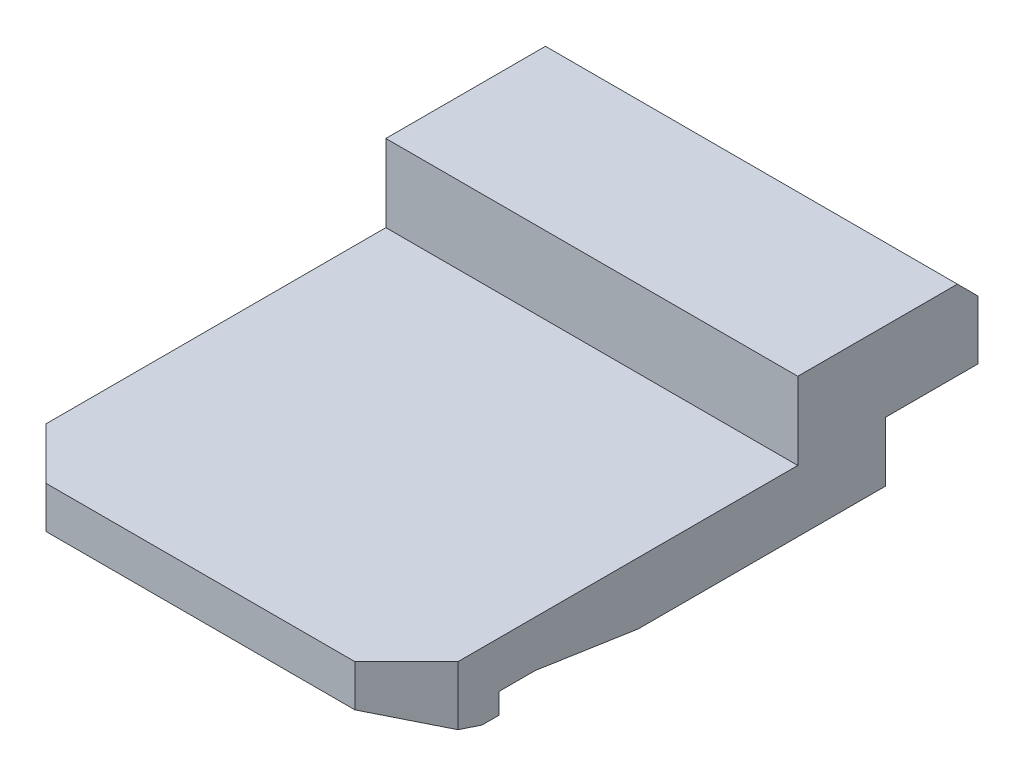
ISO-10303-21;
HEADER;
FILE_DESCRIPTION(('STEP AP214'),'2;1');
FILE_NAME('part.step','',(''),(''),'','','');
FILE_SCHEMA(('AUTOMOTIVE_DESIGN { 1 0 10303 214 1 1 1 1 }'));
ENDSEC;
DATA;
#1=APPLICATION_CONTEXT('core data for automotive mechanical design processes');
#2=APPLICATION_PROTOCOL_DEFINITION('international standard','automotive_design',2000,#1);
#3=PRODUCT_CONTEXT('',#1,'mechanical');
#4=PRODUCT('Part','Part','',(#3));
#5=PRODUCT_RELATED_PRODUCT_CATEGORY('part','',(#4));
#6=PRODUCT_DEFINITION_FORMATION('','',#4);
#7=PRODUCT_DEFINITION_CONTEXT('part definition',#1,'design');
#8=PRODUCT_DEFINITION('design','',#6,#7);
#9=PRODUCT_DEFINITION_SHAPE('','',#8);
#10=(LENGTH_UNIT() NAMED_UNIT(*) SI_UNIT(.MILLI.,.METRE.));
#11=(NAMED_UNIT(*) PLANE_ANGLE_UNIT() SI_UNIT($,.RADIAN.));
#12=(NAMED_UNIT(*) SI_UNIT($,.STERADIAN.) SOLID_ANGLE_UNIT());
#13=UNCERTAINTY_MEASURE_WITH_UNIT(LENGTH_MEASURE(1.E-05),#10,'distance_accuracy_value','');
#14=(GEOMETRIC_REPRESENTATION_CONTEXT(3) GLOBAL_UNCERTAINTY_ASSIGNED_CONTEXT((#13)) GLOBAL_UNIT_ASSIGNED_CONTEXT((#10,
#11,#12)) REPRESENTATION_CONTEXT('',''));
#15=CARTESIAN_POINT('',(0.,0.,0.));
#16=DIRECTION('',(0.,0.,1.));
#17=DIRECTION('',(1.,0.,0.));
#18=AXIS2_PLACEMENT_3D('',#15,#16,#17);
#19=CARTESIAN_POINT('',(0.,11.05,-16.8));
#20=DIRECTION('',(0.,0.707106781186548,-0.707106781186548));
#21=DIRECTION('',(-1.,0.,0.));
#22=AXIS2_PLACEMENT_3D('',#19,#20,#21);
#23=PLANE('',#22);
#24=DIRECTION('',(0.,0.707106781186498,0.707106781186598));
#25=VECTOR('',#24,1.);
#26=CARTESIAN_POINT('',(4.,10.85,-17.));
#27=LINE('',#26,#25);
#28=CARTESIAN_POINT('',(4.,10.85,-17.));
#29=VERTEX_POINT('',#28);
#30=CARTESIAN_POINT('',(4.,11.25,-16.6));
#31=VERTEX_POINT('',#30);
#32=EDGE_CURVE('E262',#29,#31,#27,.T.);
#33=ORIENTED_EDGE('',*,*,#32,.F.);
#34=DIRECTION('',(1.,0.,0.));
#35=VECTOR('',#34,1.);
#36=CARTESIAN_POINT('',(-4.,10.85,-17.));
#37=LINE('',#36,#35);
#38=CARTESIAN_POINT('',(-4.,10.85,-17.));
#39=VERTEX_POINT('',#38);
#40=EDGE_CURVE('E244',#39,#29,#37,.T.);
#41=ORIENTED_EDGE('',*,*,#40,.F.);
#42=DIRECTION('',(0.,-0.707106781186498,-0.707106781186598));
#43=VECTOR('',#42,1.);
#44=CARTESIAN_POINT('',(-4.,11.25,-16.6));
#45=LINE('',#44,#43);
#46=CARTESIAN_POINT('',(-4.,11.25,-16.6));
#47=VERTEX_POINT('',#46);
#48=EDGE_CURVE('E289',#47,#39,#45,.T.);
#49=ORIENTED_EDGE('',*,*,#48,.F.);
#50=DIRECTION('',(1.,0.,0.));
#51=VECTOR('',#50,1.);
#52=CARTESIAN_POINT('',(-4.,11.25,-16.6));
#53=LINE('',#52,#51);
#54=EDGE_CURVE('E11',#47,#31,#53,.T.);
#55=ORIENTED_EDGE('',*,*,#54,.T.);
#56=EDGE_LOOP('',(#33,#41,#49,#55));
#57=FACE_BOUND('',#56,.T.);
#58=ADVANCED_FACE('F16',(#57),#23,.T.);
#59=CARTESIAN_POINT('',(4.,11.25,-17.));
#60=DIRECTION('',(0.,1.,0.));
#61=DIRECTION('',(1.,0.,0.));
#62=AXIS2_PLACEMENT_3D('',#59,#60,#61);
#63=PLANE('',#62);
#64=ORIENTED_EDGE('',*,*,#54,.F.);
#65=DIRECTION('',(0.,0.,-1.));
#66=VECTOR('',#65,1.);
#67=CARTESIAN_POINT('',(-4.,11.25,-13.5));
#68=LINE('',#67,#66);
#69=CARTESIAN_POINT('',(-4.,11.25,-13.5));
#70=VERTEX_POINT('',#69);
#71=EDGE_CURVE('E285',#70,#47,#68,.T.);
#72=ORIENTED_EDGE('',*,*,#71,.F.);
#73=DIRECTION('',(1.,0.,0.));
#74=VECTOR('',#73,1.);
#75=CARTESIAN_POINT('',(-4.,11.25,-13.5));
#76=LINE('',#75,#74);
#77=CARTESIAN_POINT('',(4.,11.25,-13.5));
#78=VERTEX_POINT('',#77);
#79=EDGE_CURVE('E338',#70,#78,#76,.T.);
#80=ORIENTED_EDGE('',*,*,#79,.T.);
#81=DIRECTION('',(0.,0.,-1.));
#82=VECTOR('',#81,1.);
#83=CARTESIAN_POINT('',(4.,11.25,-13.5));
#84=LINE('',#83,#82);
#85=EDGE_CURVE('E257',#78,#31,#84,.T.);
#86=ORIENTED_EDGE('',*,*,#85,.T.);
#87=EDGE_LOOP('',(#64,#72,#80,#86));
#88=FACE_BOUND('',#87,.T.);
#89=ADVANCED_FACE('F492',(#88),#63,.T.);
#90=CARTESIAN_POINT('',(4.,0.,-14.7));
#91=DIRECTION('',(0.,0.,-1.));
#92=DIRECTION('',(0.,-1.,0.));
#93=AXIS2_PLACEMENT_3D('',#90,#91,#92);
#94=PLANE('',#93);
#95=DIRECTION('',(1.,0.,0.));
#96=VECTOR('',#95,1.);
#97=CARTESIAN_POINT('',(-3.115686120263,8.55,-14.7));
#98=LINE('',#97,#96);
#99=CARTESIAN_POINT('',(-3.115686120263,8.55,-14.7));
#100=VERTEX_POINT('',#99);
#101=CARTESIAN_POINT('',(3.115686120263,8.55,-14.7));
#102=VERTEX_POINT('',#101);
#103=EDGE_CURVE('E190',#100,#102,#98,.T.);
#104=ORIENTED_EDGE('',*,*,#103,.F.);
#105=CARTESIAN_POINT('',(0.,0.,-14.7));
#106=DIRECTION('',(0.,0.,-1.));
#107=DIRECTION('',(-0.342383090138813,0.939560439560435,0.));
#108=AXIS2_PLACEMENT_3D('',#105,#106,#107);
#109=CIRCLE('',#108,9.1);
#110=EDGE_CURVE('E24',#100,#102,#109,.T.);
#111=ORIENTED_EDGE('',*,*,#110,.T.);
#112=EDGE_LOOP('',(#104,#111));
#113=FACE_BOUND('',#112,.T.);
#114=ADVANCED_FACE('F517',(#113),#94,.T.);
#115=CARTESIAN_POINT('',(0.,0.,-15.2));
#116=DIRECTION('',(0.,0.,-1.));
#117=DIRECTION('',(-1.,0.,0.));
#118=AXIS2_PLACEMENT_3D('',#115,#116,#117);
#119=CYLINDRICAL_SURFACE('',#118,9.1);
#120=DIRECTION('',(0.,0.,-1.));
#121=VECTOR('',#120,1.);
#122=CARTESIAN_POINT('',(-3.115686120263,8.55,-14.7));
#123=LINE('',#122,#121);
#124=CARTESIAN_POINT('',(-3.115686120263,8.55,-15.2));
#125=VERTEX_POINT('',#124);
#126=EDGE_CURVE('E185',#100,#125,#123,.T.);
#127=ORIENTED_EDGE('',*,*,#126,.T.);
#128=CARTESIAN_POINT('',(0.,0.,-15.2));
#129=DIRECTION('',(0.,0.,-1.));
#130=DIRECTION('',(-0.342383090138813,0.939560439560435,0.));
#131=AXIS2_PLACEMENT_3D('',#128,#129,#130);
#132=CIRCLE('',#131,9.1);
#133=CARTESIAN_POINT('',(3.115686120263,8.55,-15.2));
#134=VERTEX_POINT('',#133);
#135=EDGE_CURVE('E36',#125,#134,#132,.T.);
#136=ORIENTED_EDGE('',*,*,#135,.T.);
#137=DIRECTION('',(0.,0.,-1.));
#138=VECTOR('',#137,1.);
#139=CARTESIAN_POINT('',(3.115686120263,8.55,-14.7));
#140=LINE('',#139,#138);
#141=EDGE_CURVE('E208',#102,#134,#140,.T.);
#142=ORIENTED_EDGE('',*,*,#141,.F.);
#143=ORIENTED_EDGE('',*,*,#110,.F.);
#144=EDGE_LOOP('',(#127,#136,#142,#143));
#145=FACE_BOUND('',#144,.T.);
#146=ADVANCED_FACE('F186',(#145),#119,.F.);
#147=CARTESIAN_POINT('',(4.,8.55,-15.2));
#148=DIRECTION('',(0.,0.,-1.));
#149=DIRECTION('',(0.,-1.,0.));
#150=AXIS2_PLACEMENT_3D('',#147,#148,#149);
#151=PLANE('',#150);
#152=ORIENTED_EDGE('',*,*,#135,.F.);
#153=DIRECTION('',(1.,0.,0.));
#154=VECTOR('',#153,1.);
#155=CARTESIAN_POINT('',(-4.,8.55,-15.2));
#156=LINE('',#155,#154);
#157=CARTESIAN_POINT('',(-4.,8.55,-15.2));
#158=VERTEX_POINT('',#157);
#159=EDGE_CURVE('E177',#158,#125,#156,.T.);
#160=ORIENTED_EDGE('',*,*,#159,.F.);
#161=DIRECTION('',(0.,1.,0.));
#162=VECTOR('',#161,1.);
#163=CARTESIAN_POINT('',(-4.,8.55,-15.2));
#164=LINE('',#163,#162);
#165=CARTESIAN_POINT('',(-4.,9.708243919474,-15.2));
#166=VERTEX_POINT('',#165);
#167=EDGE_CURVE('E293',#158,#166,#164,.T.);
#168=ORIENTED_EDGE('',*,*,#167,.T.);
#169=CARTESIAN_POINT('',(0.,0.,-15.2));
#170=DIRECTION('',(0.,0.,-1.));
#171=DIRECTION('',(-0.380952380952399,0.924594658997497,0.));
#172=AXIS2_PLACEMENT_3D('',#169,#170,#171);
#173=CIRCLE('',#172,10.5);
#174=CARTESIAN_POINT('',(4.,9.708243919474,-15.2));
#175=VERTEX_POINT('',#174);
#176=EDGE_CURVE('E223',#166,#175,#173,.T.);
#177=ORIENTED_EDGE('',*,*,#176,.T.);
#178=DIRECTION('',(0.,-1.,0.));
#179=VECTOR('',#178,1.);
#180=CARTESIAN_POINT('',(4.,9.708243919474,-15.2));
#181=LINE('',#180,#179);
#182=CARTESIAN_POINT('',(4.,8.55,-15.2));
#183=VERTEX_POINT('',#182);
#184=EDGE_CURVE('E381',#175,#183,#181,.T.);
#185=ORIENTED_EDGE('',*,*,#184,.T.);
#186=DIRECTION('',(1.,0.,0.));
#187=VECTOR('',#186,1.);
#188=CARTESIAN_POINT('',(3.115686120263,8.55,-15.2));
#189=LINE('',#188,#187);
#190=EDGE_CURVE('E180',#134,#183,#189,.T.);
#191=ORIENTED_EDGE('',*,*,#190,.F.);
#192=EDGE_LOOP('',(#152,#160,#168,#177,#185,#191));
#193=FACE_BOUND('',#192,.T.);
#194=ADVANCED_FACE('F175',(#193),#151,.T.);
#195=CARTESIAN_POINT('',(4.,8.55,-5.9));
#196=DIRECTION('',(0.,-1.,0.));
#197=DIRECTION('',(0.,0.,-1.));
#198=AXIS2_PLACEMENT_3D('',#195,#196,#197);
#199=PLANE('',#198);
#200=DIRECTION('',(-1.,0.,0.));
#201=VECTOR('',#200,1.);
#202=CARTESIAN_POINT('',(4.,8.55,-10.4));
#203=LINE('',#202,#201);
#204=CARTESIAN_POINT('',(4.,8.55,-10.4));
#205=VERTEX_POINT('',#204);
#206=CARTESIAN_POINT('',(-4.,8.55,-10.4));
#207=VERTEX_POINT('',#206);
#208=EDGE_CURVE('E197',#205,#207,#203,.T.);
#209=ORIENTED_EDGE('',*,*,#208,.T.);
#210=DIRECTION('',(0.,0.,1.));
#211=VECTOR('',#210,1.);
#212=CARTESIAN_POINT('',(-4.,8.55,-15.2));
#213=LINE('',#212,#211);
#214=EDGE_CURVE('E194',#158,#207,#213,.T.);
#215=ORIENTED_EDGE('',*,*,#214,.F.);
#216=ORIENTED_EDGE('',*,*,#159,.T.);
#217=ORIENTED_EDGE('',*,*,#126,.F.);
#218=ORIENTED_EDGE('',*,*,#103,.T.);
#219=ORIENTED_EDGE('',*,*,#141,.T.);
#220=ORIENTED_EDGE('',*,*,#190,.T.);
#221=DIRECTION('',(0.,0.,-1.));
#222=VECTOR('',#221,1.);
#223=CARTESIAN_POINT('',(4.,8.55,-10.4));
#224=LINE('',#223,#222);
#225=EDGE_CURVE('E377',#205,#183,#224,.T.);
#226=ORIENTED_EDGE('',*,*,#225,.F.);
#227=EDGE_LOOP('',(#209,#215,#216,#217,#218,#219,#220,#226));
#228=FACE_BOUND('',#227,.T.);
#229=ADVANCED_FACE('F192',(#228),#199,.T.);
#230=CARTESIAN_POINT('',(0.,8.7,-9.4));
#231=DIRECTION('',(0.,-0.988936352868304,0.148340452930201));
#232=DIRECTION('',(-1.,0.,0.));
#233=AXIS2_PLACEMENT_3D('',#230,#231,#232);
#234=PLANE('',#233);
#235=DIRECTION('',(0.,0.148340452930201,0.988936352868304));
#236=VECTOR('',#235,1.);
#237=CARTESIAN_POINT('',(-4.,8.55,-10.4));
#238=LINE('',#237,#236);
#239=CARTESIAN_POINT('',(-4.,8.85,-8.4));
#240=VERTEX_POINT('',#239);
#241=EDGE_CURVE('E298',#207,#240,#238,.T.);
#242=ORIENTED_EDGE('',*,*,#241,.F.);
#243=ORIENTED_EDGE('',*,*,#208,.F.);
#244=DIRECTION('',(0.,-0.148340452930201,-0.988936352868304));
#245=VECTOR('',#244,1.);
#246=CARTESIAN_POINT('',(4.,8.85,-8.4));
#247=LINE('',#246,#245);
#248=CARTESIAN_POINT('',(4.,8.85,-8.4));
#249=VERTEX_POINT('',#248);
#250=EDGE_CURVE('E373',#249,#205,#247,.T.);
#251=ORIENTED_EDGE('',*,*,#250,.F.);
#252=DIRECTION('',(-1.,0.,0.));
#253=VECTOR('',#252,1.);
#254=CARTESIAN_POINT('',(4.,8.85,-8.4));
#255=LINE('',#254,#253);
#256=EDGE_CURVE('E202',#249,#240,#255,.T.);
#257=ORIENTED_EDGE('',*,*,#256,.T.);
#258=EDGE_LOOP('',(#242,#243,#251,#257));
#259=FACE_BOUND('',#258,.T.);
#260=ADVANCED_FACE('F576',(#259),#234,.T.);
#261=CARTESIAN_POINT('',(-4.,8.85,-7.7));
#262=DIRECTION('',(0.,1.,0.));
#263=DIRECTION('',(1.,0.,0.));
#264=AXIS2_PLACEMENT_3D('',#261,#262,#263);
#265=PLANE('',#264);
#266=ORIENTED_EDGE('',*,*,#256,.F.);
#267=DIRECTION('',(0.,0.,-1.));
#268=VECTOR('',#267,1.);
#269=CARTESIAN_POINT('',(4.,8.85,-7.7));
#270=LINE('',#269,#268);
#271=CARTESIAN_POINT('',(4.,8.85,-7.7));
#272=VERTEX_POINT('',#271);
#273=EDGE_CURVE('E369',#272,#249,#270,.T.);
#274=ORIENTED_EDGE('',*,*,#273,.F.);
#275=DIRECTION('',(1.,0.,0.));
#276=VECTOR('',#275,1.);
#277=CARTESIAN_POINT('',(-4.,8.85,-7.7));
#278=LINE('',#277,#276);
#279=CARTESIAN_POINT('',(-4.,8.85,-7.7));
#280=VERTEX_POINT('',#279);
#281=EDGE_CURVE('E292',#280,#272,#278,.T.);
#282=ORIENTED_EDGE('',*,*,#281,.F.);
#283=DIRECTION('',(0.,0.,-1.));
#284=VECTOR('',#283,1.);
#285=CARTESIAN_POINT('',(-4.,8.85,-7.7));
#286=LINE('',#285,#284);
#287=EDGE_CURVE('E302',#280,#240,#286,.T.);
#288=ORIENTED_EDGE('',*,*,#287,.T.);
#289=EDGE_LOOP('',(#266,#274,#282,#288));
#290=FACE_BOUND('',#289,.T.);
#291=ADVANCED_FACE('F412',(#290),#265,.F.);
#292=CARTESIAN_POINT('',(-4.,8.55,-7.7));
#293=DIRECTION('',(0.,0.,1.));
#294=DIRECTION('',(1.,0.,0.));
#295=AXIS2_PLACEMENT_3D('',#292,#293,#294);
#296=PLANE('',#295);
#297=DIRECTION('',(0.,1.,0.));
#298=VECTOR('',#297,1.);
#299=CARTESIAN_POINT('',(-4.,8.45,-7.7));
#300=LINE('',#299,#298);
#301=CARTESIAN_POINT('',(-4.,8.45,-7.7));
#302=VERTEX_POINT('',#301);
#303=EDGE_CURVE('E269',#302,#280,#300,.T.);
#304=ORIENTED_EDGE('',*,*,#303,.T.);
#305=ORIENTED_EDGE('',*,*,#281,.T.);
#306=DIRECTION('',(0.,1.,0.));
#307=VECTOR('',#306,1.);
#308=CARTESIAN_POINT('',(4.,8.45,-7.7));
#309=LINE('',#308,#307);
#310=CARTESIAN_POINT('',(4.,8.45,-7.7));
#311=VERTEX_POINT('',#310);
#312=EDGE_CURVE('E365',#311,#272,#309,.T.);
#313=ORIENTED_EDGE('',*,*,#312,.F.);
#314=DIRECTION('',(-1.,0.,0.));
#315=VECTOR('',#314,1.);
#316=CARTESIAN_POINT('',(4.,8.45,-7.7));
#317=LINE('',#316,#315);
#318=EDGE_CURVE('E205',#311,#302,#317,.T.);
#319=ORIENTED_EDGE('',*,*,#318,.T.);
#320=EDGE_LOOP('',(#304,#305,#313,#319));
#321=FACE_BOUND('',#320,.T.);
#322=ADVANCED_FACE('F401',(#321),#296,.F.);
#323=CARTESIAN_POINT('',(4.,8.45,-7.366666666667));
#324=DIRECTION('',(0.,-1.,0.));
#325=DIRECTION('',(0.,0.,-1.));
#326=AXIS2_PLACEMENT_3D('',#323,#324,#325);
#327=PLANE('',#326);
#328=DIRECTION('',(0.,0.,-1.));
#329=VECTOR('',#328,1.);
#330=CARTESIAN_POINT('',(4.,8.45,-7.366666666667));
#331=LINE('',#330,#329);
#332=CARTESIAN_POINT('',(4.,8.45,-7.366666666667));
#333=VERTEX_POINT('',#332);
#334=EDGE_CURVE('E360',#333,#311,#331,.T.);
#335=ORIENTED_EDGE('',*,*,#334,.F.);
#336=DIRECTION('',(-1.,0.,0.));
#337=VECTOR('',#336,1.);
#338=CARTESIAN_POINT('',(4.,8.45,-7.366666666667));
#339=LINE('',#338,#337);
#340=CARTESIAN_POINT('',(-4.,8.45,-7.366666666667));
#341=VERTEX_POINT('',#340);
#342=EDGE_CURVE('E330',#333,#341,#339,.T.);
#343=ORIENTED_EDGE('',*,*,#342,.T.);
#344=DIRECTION('',(0.,0.,-1.));
#345=VECTOR('',#344,1.);
#346=CARTESIAN_POINT('',(-4.,8.45,-7.366666666667));
#347=LINE('',#346,#345);
#348=EDGE_CURVE('E264',#341,#302,#347,.T.);
#349=ORIENTED_EDGE('',*,*,#348,.T.);
#350=ORIENTED_EDGE('',*,*,#318,.F.);
#351=EDGE_LOOP('',(#335,#343,#349,#350));
#352=FACE_BOUND('',#351,.T.);
#353=ADVANCED_FACE('F405',(#352),#327,.T.);
#354=CARTESIAN_POINT('',(4.,8.938888888889,-5.9));
#355=DIRECTION('',(0.,-0.948683298050524,0.316227766016808));
#356=DIRECTION('',(-1.,0.,0.));
#357=AXIS2_PLACEMENT_3D('',#354,#355,#356);
#358=PLANE('',#357);
#359=DIRECTION('',(-0.68824720161168,0.229415733870593,0.68824720161168));
#360=VECTOR('',#359,1.);
#361=CARTESIAN_POINT('',(4.,8.605555555556,-6.9));
#362=LINE('',#361,#360);
#363=CARTESIAN_POINT('',(4.,8.605555555556,-6.9));
#364=VERTEX_POINT('',#363);
#365=CARTESIAN_POINT('',(3.,8.938888888889,-5.9));
#366=VERTEX_POINT('',#365);
#367=EDGE_CURVE('E317',#364,#366,#362,.T.);
#368=ORIENTED_EDGE('',*,*,#367,.T.);
#369=DIRECTION('',(-1.,0.,0.));
#370=VECTOR('',#369,1.);
#371=CARTESIAN_POINT('',(3.,8.938888888889,-5.9));
#372=LINE('',#371,#370);
#373=CARTESIAN_POINT('',(-3.,8.938888888889,-5.9));
#374=VERTEX_POINT('',#373);
#375=EDGE_CURVE('E316',#366,#374,#372,.T.);
#376=ORIENTED_EDGE('',*,*,#375,.T.);
#377=DIRECTION('',(-0.68824720161168,-0.229415733870593,-0.68824720161168));
#378=VECTOR('',#377,1.);
#379=CARTESIAN_POINT('',(-3.,8.938888888889,-5.9));
#380=LINE('',#379,#378);
#381=CARTESIAN_POINT('',(-4.,8.605555555556,-6.9));
#382=VERTEX_POINT('',#381);
#383=EDGE_CURVE('E327',#374,#382,#380,.T.);
#384=ORIENTED_EDGE('',*,*,#383,.T.);
#385=DIRECTION('',(0.,-0.316227766016808,-0.948683298050524));
#386=VECTOR('',#385,1.);
#387=CARTESIAN_POINT('',(-4.,8.605555555556,-6.9));
#388=LINE('',#387,#386);
#389=EDGE_CURVE('E268',#382,#341,#388,.T.);
#390=ORIENTED_EDGE('',*,*,#389,.T.);
#391=ORIENTED_EDGE('',*,*,#342,.F.);
#392=DIRECTION('',(0.,-0.316227766016808,-0.948683298050524));
#393=VECTOR('',#392,1.);
#394=CARTESIAN_POINT('',(4.,8.605555555556,-6.9));
#395=LINE('',#394,#393);
#396=EDGE_CURVE('E357',#364,#333,#395,.T.);
#397=ORIENTED_EDGE('',*,*,#396,.F.);
#398=EDGE_LOOP('',(#368,#376,#384,#390,#391,#397));
#399=FACE_BOUND('',#398,.T.);
#400=ADVANCED_FACE('F420',(#399),#358,.T.);
#401=CARTESIAN_POINT('',(-3.5,9.35,-6.4));
#402=DIRECTION('',(-0.707106781186548,0.,0.707106781186548));
#403=DIRECTION('',(0.,1.,0.));
#404=AXIS2_PLACEMENT_3D('',#401,#402,#403);
#405=PLANE('',#404);
#406=DIRECTION('',(0.,1.,0.));
#407=VECTOR('',#406,1.);
#408=CARTESIAN_POINT('',(-4.,8.605555555556,-6.9));
#409=LINE('',#408,#407);
#410=CARTESIAN_POINT('',(-4.,9.75,-6.9));
#411=VERTEX_POINT('',#410);
#412=EDGE_CURVE('E312',#382,#411,#409,.T.);
#413=ORIENTED_EDGE('',*,*,#412,.F.);
#414=ORIENTED_EDGE('',*,*,#383,.F.);
#415=DIRECTION('',(0.,1.,0.));
#416=VECTOR('',#415,1.);
#417=CARTESIAN_POINT('',(-3.,8.938888888889,-5.9));
#418=LINE('',#417,#416);
#419=CARTESIAN_POINT('',(-3.,9.75,-5.9));
#420=VERTEX_POINT('',#419);
#421=EDGE_CURVE('E313',#374,#420,#418,.T.);
#422=ORIENTED_EDGE('',*,*,#421,.T.);
#423=DIRECTION('',(0.707106781186548,0.,0.707106781186548));
#424=VECTOR('',#423,1.);
#425=CARTESIAN_POINT('',(-4.,9.75,-6.9));
#426=LINE('',#425,#424);
#427=EDGE_CURVE('E254',#411,#420,#426,.T.);
#428=ORIENTED_EDGE('',*,*,#427,.F.);
#429=EDGE_LOOP('',(#413,#414,#422,#428));
#430=FACE_BOUND('',#429,.T.);
#431=ADVANCED_FACE('F426',(#430),#405,.T.);
#432=CARTESIAN_POINT('',(4.,9.65,-5.9));
#433=DIRECTION('',(0.,0.,1.));
#434=DIRECTION('',(1.,0.,0.));
#435=AXIS2_PLACEMENT_3D('',#432,#433,#434);
#436=PLANE('',#435);
#437=ORIENTED_EDGE('',*,*,#421,.F.);
#438=ORIENTED_EDGE('',*,*,#375,.F.);
#439=DIRECTION('',(0.,-1.,0.));
#440=VECTOR('',#439,1.);
#441=CARTESIAN_POINT('',(3.,9.75,-5.9));
#442=LINE('',#441,#440);
#443=CARTESIAN_POINT('',(3.,9.75,-5.9));
#444=VERTEX_POINT('',#443);
#445=EDGE_CURVE('E261',#444,#366,#442,.T.);
#446=ORIENTED_EDGE('',*,*,#445,.F.);
#447=DIRECTION('',(1.,0.,0.));
#448=VECTOR('',#447,1.);
#449=CARTESIAN_POINT('',(-3.,9.75,-5.9));
#450=LINE('',#449,#448);
#451=EDGE_CURVE('E342',#420,#444,#450,.T.);
#452=ORIENTED_EDGE('',*,*,#451,.F.);
#453=EDGE_LOOP('',(#437,#438,#446,#452));
#454=FACE_BOUND('',#453,.T.);
#455=ADVANCED_FACE('F505',(#454),#436,.T.);
#456=CARTESIAN_POINT('',(3.5,9.35,-6.4));
#457=DIRECTION('',(0.707106781186548,0.,0.707106781186548));
#458=DIRECTION('',(0.,-1.,0.));
#459=AXIS2_PLACEMENT_3D('',#456,#457,#458);
#460=PLANE('',#459);
#461=ORIENTED_EDGE('',*,*,#445,.T.);
#462=ORIENTED_EDGE('',*,*,#367,.F.);
#463=DIRECTION('',(0.,1.,0.));
#464=VECTOR('',#463,1.);
#465=CARTESIAN_POINT('',(4.,8.605555555556,-6.9));
#466=LINE('',#465,#464);
#467=CARTESIAN_POINT('',(4.,9.75,-6.9));
#468=VERTEX_POINT('',#467);
#469=EDGE_CURVE('E354',#364,#468,#466,.T.);
#470=ORIENTED_EDGE('',*,*,#469,.T.);
#471=DIRECTION('',(0.707106781186548,0.,-0.707106781186548));
#472=VECTOR('',#471,1.);
#473=CARTESIAN_POINT('',(3.,9.75,-5.9));
#474=LINE('',#473,#472);
#475=EDGE_CURVE('E346',#444,#468,#474,.T.);
#476=ORIENTED_EDGE('',*,*,#475,.F.);
#477=EDGE_LOOP('',(#461,#462,#470,#476));
#478=FACE_BOUND('',#477,.T.);
#479=ADVANCED_FACE('F508',(#478),#460,.T.);
#480=CARTESIAN_POINT('',(4.,9.45,-17.));
#481=DIRECTION('',(1.,0.,0.));
#482=DIRECTION('',(0.,1.,0.));
#483=AXIS2_PLACEMENT_3D('',#480,#481,#482);
#484=PLANE('',#483);
#485=ORIENTED_EDGE('',*,*,#469,.F.);
#486=ORIENTED_EDGE('',*,*,#396,.T.);
#487=ORIENTED_EDGE('',*,*,#334,.T.);
#488=ORIENTED_EDGE('',*,*,#312,.T.);
#489=ORIENTED_EDGE('',*,*,#273,.T.);
#490=ORIENTED_EDGE('',*,*,#250,.T.);
#491=ORIENTED_EDGE('',*,*,#225,.T.);
#492=ORIENTED_EDGE('',*,*,#184,.F.);
#493=DIRECTION('',(0.,0.,-1.));
#494=VECTOR('',#493,1.);
#495=CARTESIAN_POINT('',(4.,9.708243919474,-15.2));
#496=LINE('',#495,#494);
#497=CARTESIAN_POINT('',(4.,9.708243919474,-17.));
#498=VERTEX_POINT('',#497);
#499=EDGE_CURVE('E227',#175,#498,#496,.T.);
#500=ORIENTED_EDGE('',*,*,#499,.T.);
#501=DIRECTION('',(0.,-1.,0.));
#502=VECTOR('',#501,1.);
#503=CARTESIAN_POINT('',(4.,10.85,-17.));
#504=LINE('',#503,#502);
#505=EDGE_CURVE('E247',#29,#498,#504,.T.);
#506=ORIENTED_EDGE('',*,*,#505,.F.);
#507=ORIENTED_EDGE('',*,*,#32,.T.);
#508=ORIENTED_EDGE('',*,*,#85,.F.);
#509=DIRECTION('',(0.,-1.,0.));
#510=VECTOR('',#509,1.);
#511=CARTESIAN_POINT('',(4.,11.25,-13.5));
#512=LINE('',#511,#510);
#513=CARTESIAN_POINT('',(4.,9.75,-13.5));
#514=VERTEX_POINT('',#513);
#515=EDGE_CURVE('E334',#78,#514,#512,.T.);
#516=ORIENTED_EDGE('',*,*,#515,.T.);
#517=DIRECTION('',(0.,0.,-1.));
#518=VECTOR('',#517,1.);
#519=CARTESIAN_POINT('',(4.,9.75,-6.9));
#520=LINE('',#519,#518);
#521=EDGE_CURVE('E350',#468,#514,#520,.T.);
#522=ORIENTED_EDGE('',*,*,#521,.F.);
#523=EDGE_LOOP('',(#485,#486,#487,#488,#489,#490,#491,#492,#500,#506,#507,#508,#516,#522));
#524=FACE_BOUND('',#523,.T.);
#525=ADVANCED_FACE('F416',(#524),#484,.T.);
#526=CARTESIAN_POINT('',(4.,9.75,0.));
#527=DIRECTION('',(0.,1.,0.));
#528=DIRECTION('',(1.,0.,0.));
#529=AXIS2_PLACEMENT_3D('',#526,#527,#528);
#530=PLANE('',#529);
#531=DIRECTION('',(1.,0.,0.));
#532=VECTOR('',#531,1.);
#533=CARTESIAN_POINT('',(-4.,9.75,-13.5));
#534=LINE('',#533,#532);
#535=CARTESIAN_POINT('',(-4.,9.75,-13.5));
#536=VERTEX_POINT('',#535);
#537=EDGE_CURVE('E325',#536,#514,#534,.T.);
#538=ORIENTED_EDGE('',*,*,#537,.F.);
#539=DIRECTION('',(0.,0.,1.));
#540=VECTOR('',#539,1.);
#541=CARTESIAN_POINT('',(-4.,9.75,-13.5));
#542=LINE('',#541,#540);
#543=EDGE_CURVE('E321',#536,#411,#542,.T.);
#544=ORIENTED_EDGE('',*,*,#543,.T.);
#545=ORIENTED_EDGE('',*,*,#427,.T.);
#546=ORIENTED_EDGE('',*,*,#451,.T.);
#547=ORIENTED_EDGE('',*,*,#475,.T.);
#548=ORIENTED_EDGE('',*,*,#521,.T.);
#549=EDGE_LOOP('',(#538,#544,#545,#546,#547,#548));
#550=FACE_BOUND('',#549,.T.);
#551=ADVANCED_FACE('F432',(#550),#530,.T.);
#552=CARTESIAN_POINT('',(0.,0.,-13.5));
#553=DIRECTION('',(0.,0.,1.));
#554=DIRECTION('',(1.,0.,0.));
#555=AXIS2_PLACEMENT_3D('',#552,#553,#554);
#556=PLANE('',#555);
#557=ORIENTED_EDGE('',*,*,#537,.T.);
#558=ORIENTED_EDGE('',*,*,#515,.F.);
#559=ORIENTED_EDGE('',*,*,#79,.F.);
#560=DIRECTION('',(0.,1.,0.));
#561=VECTOR('',#560,1.);
#562=CARTESIAN_POINT('',(-4.,9.75,-13.5));
#563=LINE('',#562,#561);
#564=EDGE_CURVE('E284',#536,#70,#563,.T.);
#565=ORIENTED_EDGE('',*,*,#564,.F.);
#566=EDGE_LOOP('',(#557,#558,#559,#565));
#567=FACE_BOUND('',#566,.T.);
#568=ADVANCED_FACE('F435',(#567),#556,.T.);
#569=CARTESIAN_POINT('',(-4.,11.25,-17.));
#570=DIRECTION('',(-1.,0.,0.));
#571=DIRECTION('',(0.,0.,1.));
#572=AXIS2_PLACEMENT_3D('',#569,#570,#571);
#573=PLANE('',#572);
#574=ORIENTED_EDGE('',*,*,#564,.T.);
#575=ORIENTED_EDGE('',*,*,#71,.T.);
#576=ORIENTED_EDGE('',*,*,#48,.T.);
#577=DIRECTION('',(0.,1.,0.));
#578=VECTOR('',#577,1.);
#579=CARTESIAN_POINT('',(-4.,9.708243919474,-17.));
#580=LINE('',#579,#578);
#581=CARTESIAN_POINT('',(-4.,9.708243919474,-17.));
#582=VERTEX_POINT('',#581);
#583=EDGE_CURVE('E239',#582,#39,#580,.T.);
#584=ORIENTED_EDGE('',*,*,#583,.F.);
#585=DIRECTION('',(0.,0.,-1.));
#586=VECTOR('',#585,1.);
#587=CARTESIAN_POINT('',(-4.,9.708243919474,-15.2));
#588=LINE('',#587,#586);
#589=EDGE_CURVE('E226',#166,#582,#588,.T.);
#590=ORIENTED_EDGE('',*,*,#589,.F.);
#591=ORIENTED_EDGE('',*,*,#167,.F.);
#592=ORIENTED_EDGE('',*,*,#214,.T.);
#593=ORIENTED_EDGE('',*,*,#241,.T.);
#594=ORIENTED_EDGE('',*,*,#287,.F.);
#595=ORIENTED_EDGE('',*,*,#303,.F.);
#596=ORIENTED_EDGE('',*,*,#348,.F.);
#597=ORIENTED_EDGE('',*,*,#389,.F.);
#598=ORIENTED_EDGE('',*,*,#412,.T.);
#599=ORIENTED_EDGE('',*,*,#543,.F.);
#600=EDGE_LOOP('',(#574,#575,#576,#584,#590,#591,#592,#593,#594,#595,#596,#597,#598,#599));
#601=FACE_BOUND('',#600,.T.);
#602=ADVANCED_FACE('F409',(#601),#573,.T.);
#603=CARTESIAN_POINT('',(0.,0.,-17.));
#604=DIRECTION('',(0.,0.,-1.));
#605=DIRECTION('',(-1.,0.,0.));
#606=AXIS2_PLACEMENT_3D('',#603,#604,#605);
#607=CYLINDRICAL_SURFACE('',#606,10.5);
#608=CARTESIAN_POINT('',(0.,0.,-17.));
#609=DIRECTION('',(0.,0.,-1.));
#610=DIRECTION('',(-0.380952380952399,0.924594658997497,0.));
#611=AXIS2_PLACEMENT_3D('',#608,#609,#610);
#612=CIRCLE('',#611,10.5);
#613=EDGE_CURVE('E235',#582,#498,#612,.T.);
#614=ORIENTED_EDGE('',*,*,#613,.T.);
#615=ORIENTED_EDGE('',*,*,#499,.F.);
#616=ORIENTED_EDGE('',*,*,#176,.F.);
#617=ORIENTED_EDGE('',*,*,#589,.T.);
#618=EDGE_LOOP('',(#614,#615,#616,#617));
#619=FACE_BOUND('',#618,.T.);
#620=ADVANCED_FACE('F515',(#619),#607,.F.);
#621=CARTESIAN_POINT('',(0.,0.,-17.));
#622=DIRECTION('',(0.,0.,1.));
#623=DIRECTION('',(1.,0.,0.));
#624=AXIS2_PLACEMENT_3D('',#621,#622,#623);
#625=PLANE('',#624);
#626=ORIENTED_EDGE('',*,*,#613,.F.);
#627=ORIENTED_EDGE('',*,*,#583,.T.);
#628=ORIENTED_EDGE('',*,*,#40,.T.);
#629=ORIENTED_EDGE('',*,*,#505,.T.);
#630=EDGE_LOOP('',(#626,#627,#628,#629));
#631=FACE_BOUND('',#630,.T.);
#632=ADVANCED_FACE('F511',(#631),#625,.F.);
#633=CLOSED_SHELL('',(#58,#89,#114,#146,#194,#229,#260,#291,#322,#353,#400,#431,#455,#479,#525,
#551,#568,#602,#620,#632));
#634=MANIFOLD_SOLID_BREP('B1',#633);
#635=ADVANCED_BREP_SHAPE_REPRESENTATION('',(#18,#634),#14);
#636=SHAPE_DEFINITION_REPRESENTATION(#9,#635);
ENDSEC;
END-ISO-10303-21;
